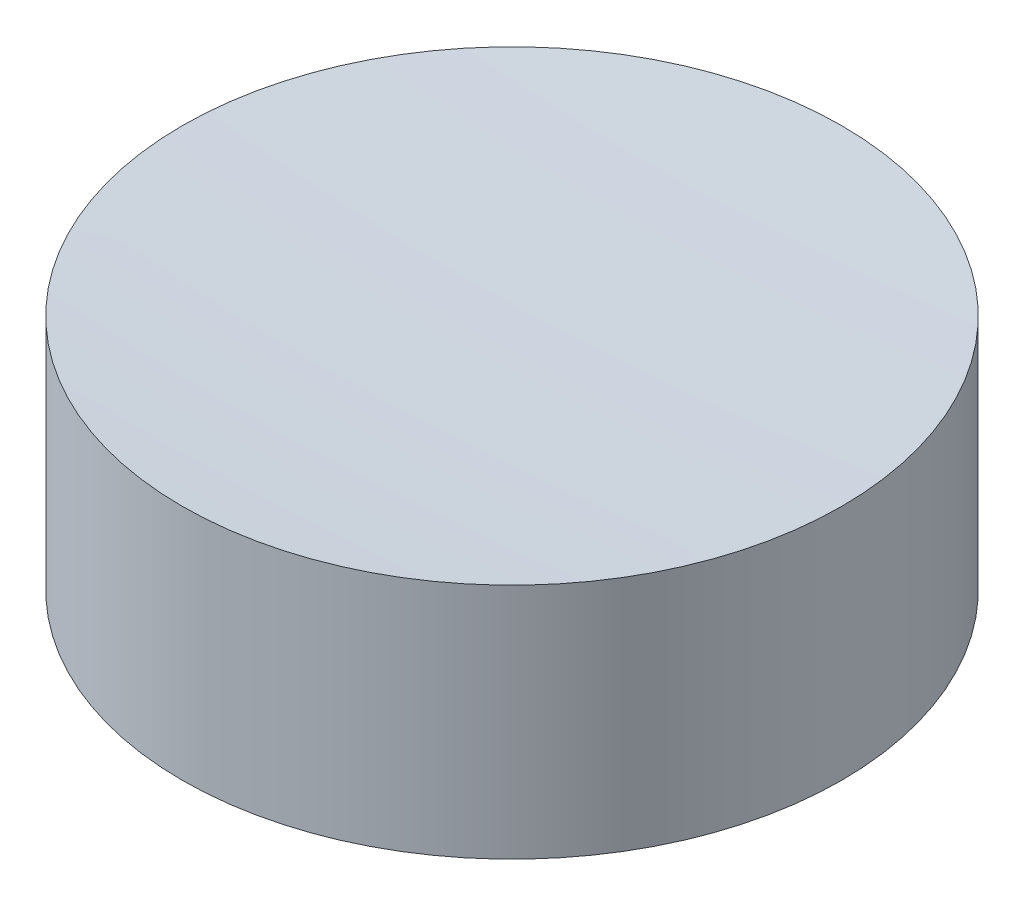
ISO-10303-21;
HEADER;
FILE_DESCRIPTION(('STEP AP214'),'2;1');
FILE_NAME('part.step','',(''),(''),'','','');
FILE_SCHEMA(('AUTOMOTIVE_DESIGN { 1 0 10303 214 1 1 1 1 }'));
ENDSEC;
DATA;
#1=APPLICATION_CONTEXT('core data for automotive mechanical design processes');
#2=APPLICATION_PROTOCOL_DEFINITION('international standard','automotive_design',2000,#1);
#3=PRODUCT_CONTEXT('',#1,'mechanical');
#4=PRODUCT('Part','Part','',(#3));
#5=PRODUCT_RELATED_PRODUCT_CATEGORY('part','',(#4));
#6=PRODUCT_DEFINITION_FORMATION('','',#4);
#7=PRODUCT_DEFINITION_CONTEXT('part definition',#1,'design');
#8=PRODUCT_DEFINITION('design','',#6,#7);
#9=PRODUCT_DEFINITION_SHAPE('','',#8);
#10=(LENGTH_UNIT() NAMED_UNIT(*) SI_UNIT(.MILLI.,.METRE.));
#11=(NAMED_UNIT(*) PLANE_ANGLE_UNIT() SI_UNIT($,.RADIAN.));
#12=(NAMED_UNIT(*) SI_UNIT($,.STERADIAN.) SOLID_ANGLE_UNIT());
#13=UNCERTAINTY_MEASURE_WITH_UNIT(LENGTH_MEASURE(1.E-05),#10,'distance_accuracy_value','');
#14=(GEOMETRIC_REPRESENTATION_CONTEXT(3) GLOBAL_UNCERTAINTY_ASSIGNED_CONTEXT((#13)) GLOBAL_UNIT_ASSIGNED_CONTEXT((#10,
#11,#12)) REPRESENTATION_CONTEXT('',''));
#15=CARTESIAN_POINT('',(0.,0.,0.));
#16=DIRECTION('',(0.,0.,1.));
#17=DIRECTION('',(1.,0.,0.));
#18=AXIS2_PLACEMENT_3D('',#15,#16,#17);
#19=CARTESIAN_POINT('',(0.,6070.34008854715,-843.244434569781));
#20=DIRECTION('',(0.,0.,1.));
#21=DIRECTION('',(0.,1.,0.));
#22=AXIS2_PLACEMENT_3D('',#19,#20,#21);
#23=SPHERICAL_SURFACE('',#22,215.430029688889);
#24=CARTESIAN_POINT('',(1.63424829224823E-13,6279.14884720386,-843.244434569781));
#25=DIRECTION('',(0.,-1.,0.));
#26=DIRECTION('',(0.,0.,-1.));
#27=AXIS2_PLACEMENT_3D('',#24,#25,#26);
#28=CIRCLE('',#27,53.);
#29=CARTESIAN_POINT('',(1.63424829224823E-13,6279.14884720386,-896.244434569781));
#30=VERTEX_POINT('',#29);
#31=EDGE_CURVE('E19',#30,#30,#28,.F.);
#32=ORIENTED_EDGE('',*,*,#31,.F.);
#33=EDGE_LOOP('',(#32));
#34=FACE_BOUND('',#33,.T.);
#35=ADVANCED_FACE('F15',(#34),#23,.F.);
#36=CARTESIAN_POINT('',(1.70530256582424E-12,7236.89105110314,-843.24443456978));
#37=DIRECTION('',(0.,0.,1.));
#38=DIRECTION('',(0.,-1.,0.));
#39=AXIS2_PLACEMENT_3D('',#36,#37,#38);
#40=SPHERICAL_SURFACE('',#39,921.120932867099);
#41=CARTESIAN_POINT('',(1.63424829224823E-13,6317.29615498531,-843.244434569781));
#42=DIRECTION('',(0.,-1.,0.));
#43=DIRECTION('',(0.,0.,-1.));
#44=AXIS2_PLACEMENT_3D('',#41,#42,#43);
#45=CIRCLE('',#44,53.);
#46=CARTESIAN_POINT('',(1.63424829224823E-13,6317.29615498531,-896.244434569781));
#47=VERTEX_POINT('',#46);
#48=EDGE_CURVE('E10',#47,#47,#45,.T.);
#49=ORIENTED_EDGE('',*,*,#48,.F.);
#50=EDGE_LOOP('',(#49));
#51=FACE_BOUND('',#50,.T.);
#52=ADVANCED_FACE('F30',(#51),#40,.F.);
#53=CARTESIAN_POINT('',(1.63424829224823E-13,6317.29615498531,-843.244434569781));
#54=DIRECTION('',(0.,-1.,0.));
#55=DIRECTION('',(0.,0.,-1.));
#56=AXIS2_PLACEMENT_3D('',#53,#54,#55);
#57=CYLINDRICAL_SURFACE('',#56,53.);
#58=ORIENTED_EDGE('',*,*,#48,.T.);
#59=EDGE_LOOP('',(#58));
#60=FACE_BOUND('',#59,.T.);
#61=ORIENTED_EDGE('',*,*,#31,.T.);
#62=EDGE_LOOP('',(#61));
#63=FACE_BOUND('',#62,.T.);
#64=ADVANCED_FACE('F17',(#60,#63),#57,.T.);
#65=CLOSED_SHELL('',(#35,#52,#64));
#66=MANIFOLD_SOLID_BREP('B1',#65);
#67=ADVANCED_BREP_SHAPE_REPRESENTATION('',(#18,#66),#14);
#68=SHAPE_DEFINITION_REPRESENTATION(#9,#67);
ENDSEC;
END-ISO-10303-21;
